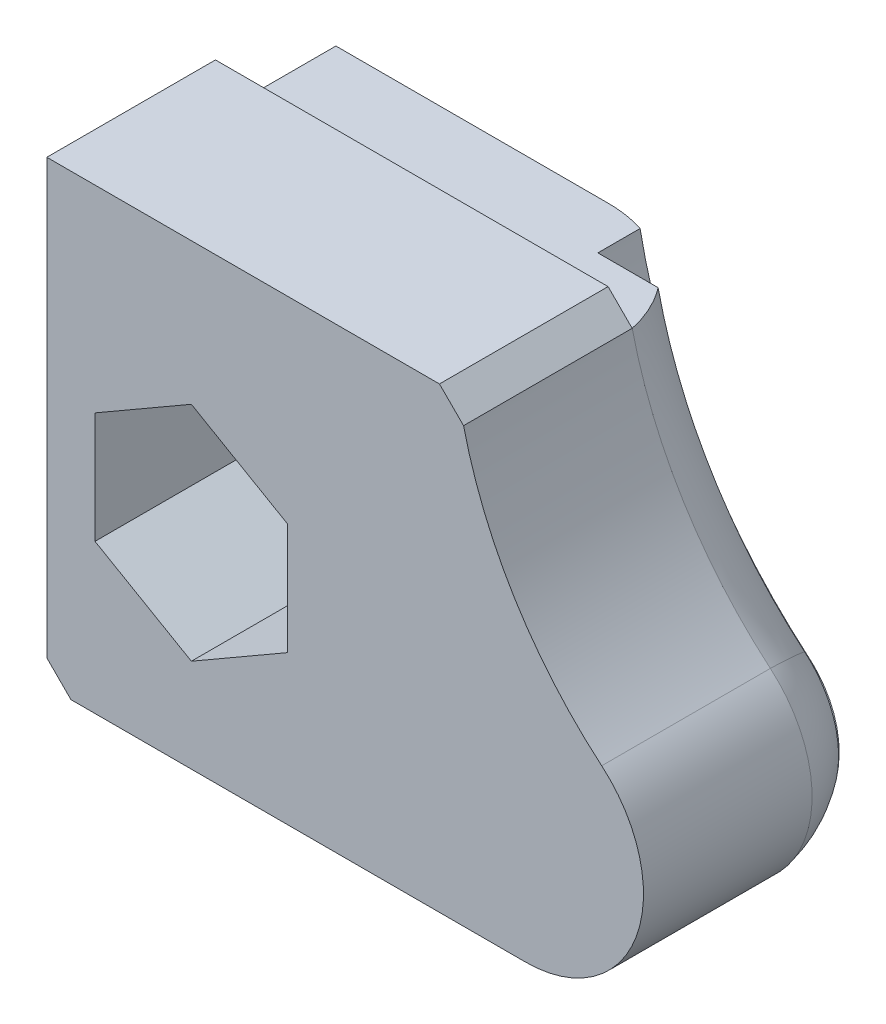
ISO-10303-21;
HEADER;
FILE_DESCRIPTION(('STEP AP214'),'2;1');
FILE_NAME('part.step','',(''),(''),'','','');
FILE_SCHEMA(('AUTOMOTIVE_DESIGN { 1 0 10303 214 1 1 1 1 }'));
ENDSEC;
DATA;
#1=APPLICATION_CONTEXT('core data for automotive mechanical design processes');
#2=APPLICATION_PROTOCOL_DEFINITION('international standard','automotive_design',2000,#1);
#3=PRODUCT_CONTEXT('',#1,'mechanical');
#4=PRODUCT('Part','Part','',(#3));
#5=PRODUCT_RELATED_PRODUCT_CATEGORY('part','',(#4));
#6=PRODUCT_DEFINITION_FORMATION('','',#4);
#7=PRODUCT_DEFINITION_CONTEXT('part definition',#1,'design');
#8=PRODUCT_DEFINITION('design','',#6,#7);
#9=PRODUCT_DEFINITION_SHAPE('','',#8);
#10=(LENGTH_UNIT() NAMED_UNIT(*) SI_UNIT(.MILLI.,.METRE.));
#11=(NAMED_UNIT(*) PLANE_ANGLE_UNIT() SI_UNIT($,.RADIAN.));
#12=(NAMED_UNIT(*) SI_UNIT($,.STERADIAN.) SOLID_ANGLE_UNIT());
#13=UNCERTAINTY_MEASURE_WITH_UNIT(LENGTH_MEASURE(1.E-05),#10,'distance_accuracy_value','');
#14=(GEOMETRIC_REPRESENTATION_CONTEXT(3) GLOBAL_UNCERTAINTY_ASSIGNED_CONTEXT((#13)) GLOBAL_UNIT_ASSIGNED_CONTEXT((#10,
#11,#12)) REPRESENTATION_CONTEXT('',''));
#15=CARTESIAN_POINT('',(0.,0.,0.));
#16=DIRECTION('',(0.,0.,1.));
#17=DIRECTION('',(1.,0.,0.));
#18=AXIS2_PLACEMENT_3D('',#15,#16,#17);
#19=CARTESIAN_POINT('',(0.,0.,5.));
#20=DIRECTION('',(0.,0.,1.));
#21=DIRECTION('',(1.,0.,0.));
#22=AXIS2_PLACEMENT_3D('',#19,#20,#21);
#23=TOROIDAL_SURFACE('',#22,22.3989794855664,5.);
#24=CARTESIAN_POINT('',(-14.4661459746452,-17.1010205144336,5.));
#25=DIRECTION('',(0.763473198654132,-0.645839511749496,0.));
#26=DIRECTION('',(0.645839511749496,0.763473198654133,0.));
#27=AXIS2_PLACEMENT_3D('',#24,#25,#26);
#28=CIRCLE('',#27,5.);
#29=CARTESIAN_POINT('',(-11.8827879276472,-14.0471277198171,2.));
#30=VERTEX_POINT('',#29);
#31=CARTESIAN_POINT('',(-11.3021914556162,-13.3607809764473,4.));
#32=VERTEX_POINT('',#31);
#33=EDGE_CURVE('E202',#30,#32,#28,.T.);
#34=ORIENTED_EDGE('',*,*,#33,.F.);
#35=CARTESIAN_POINT('',(0.,0.,2.));
#36=DIRECTION('',(0.,0.,1.));
#37=DIRECTION('',(1.,0.,0.));
#38=AXIS2_PLACEMENT_3D('',#35,#36,#37);
#39=CIRCLE('',#38,18.3989794855664);
#40=CARTESIAN_POINT('',(-17.9589099365828,-4.,2.));
#41=VERTEX_POINT('',#40);
#42=EDGE_CURVE('E61',#30,#41,#39,.F.);
#43=ORIENTED_EDGE('',*,*,#42,.T.);
#44=CARTESIAN_POINT('',(-17.0367250374008,-4.,4.));
#45=CARTESIAN_POINT('',(-17.0653817765962,-4.,3.86324225807622));
#46=CARTESIAN_POINT('',(-17.0999358907687,-4.,3.72772869698711));
#47=CARTESIAN_POINT('',(-17.1804606447674,-4.,3.46015982354573));
#48=CARTESIAN_POINT('',(-17.2264294320747,-4.,3.32810395387575));
#49=CARTESIAN_POINT('',(-17.3293440827628,-4.,3.06855383654147));
#50=CARTESIAN_POINT('',(-17.3862747744431,-4.,2.94105356960061));
#51=CARTESIAN_POINT('',(-17.5106796250823,-4.,2.69130452779398));
#52=CARTESIAN_POINT('',(-17.5781539589004,-4.,2.56905584006502));
#53=CARTESIAN_POINT('',(-17.7230812278293,-4.,2.33068257351301));
#54=CARTESIAN_POINT('',(-17.8005308056964,-4.,2.2145559527099));
#55=CARTESIAN_POINT('',(-17.9648544264224,-4.,1.98911010794165));
#56=CARTESIAN_POINT('',(-18.0517319760089,-4.,1.87979344089488));
#57=CARTESIAN_POINT('',(-18.2341911969415,-4.,1.66877227064967));
#58=CARTESIAN_POINT('',(-18.3297688994024,-4.,1.56706433465356));
#59=CARTESIAN_POINT('',(-18.5289973167957,-4.,1.37181862571009));
#60=CARTESIAN_POINT('',(-18.6326508881901,-4.,1.27828376865287));
#61=CARTESIAN_POINT('',(-18.8490807894197,-4.,1.0985014561376));
#62=CARTESIAN_POINT('',(-18.9619817957606,-4.,1.01240407017907));
#63=CARTESIAN_POINT('',(-19.1945285125645,-4.,0.849857600666171));
#64=CARTESIAN_POINT('',(-19.3141743564999,-4.,0.773408708141138));
#65=CARTESIAN_POINT('',(-19.5594519302337,-4.,0.630598944815542));
#66=CARTESIAN_POINT('',(-19.6850876893161,-4.,0.564244994085387));
#67=CARTESIAN_POINT('',(-19.9413555281012,-4.,0.442130897146087));
#68=CARTESIAN_POINT('',(-20.0719861118898,-4.,0.386367608505771));
#69=CARTESIAN_POINT('',(-20.350714429283,-4.,0.280718615795549));
#70=CARTESIAN_POINT('',(-20.499249847823,-4.,0.231983641250895));
#71=CARTESIAN_POINT('',(-20.8001281147384,-4.,0.148127527784731));
#72=CARTESIAN_POINT('',(-20.9524713823985,-4.,0.113007895149734));
#73=CARTESIAN_POINT('',(-21.259857759456,-4.,0.0566540717579046));
#74=CARTESIAN_POINT('',(-21.4149033254361,-4.,0.0354332731532387));
#75=CARTESIAN_POINT('',(-21.7262733191489,-4.,0.00709693660430523));
#76=CARTESIAN_POINT('',(-21.8825977138705,-4.,-1.89642914516628E-05));
#77=CARTESIAN_POINT('',(-22.0389265163896,-4.,0.));
#78=B_SPLINE_CURVE_WITH_KNOTS('',3,(#44,#45,#46,#47,#48,#49,#50,#51,#52,#53,#54,#55,#56,#57,#58,
#59,#60,#61,#62,#63,#64,#65,#66,#67,#68,#69,#70,#71,#72,#73,#74,#75,#76,#77),.UNSPECIFIED.,.F.,
.F.,(4,2,2,2,2,2,2,2,2,2,2,2,2,2,2,2,4),(0.,0.419043506548137,0.838019049766633,
1.25641882947906,1.67482554880858,2.09309181638023,2.51151419451018,2.92974664189645,
3.3481276970032,3.77358731554335,4.19905535638494,4.62481375350071,5.05044562274954,
5.51877395788904,5.98715409014758,6.45598486639045,6.92480357838152),.UNSPECIFIED.);
#79=CARTESIAN_POINT('',(-17.0367250374008,-4.,4.));
#80=VERTEX_POINT('',#79);
#81=EDGE_CURVE('E210',#80,#41,#78,.T.);
#82=ORIENTED_EDGE('',*,*,#81,.F.);
#83=CARTESIAN_POINT('',(0.,0.,4.));
#84=DIRECTION('',(0.,0.,-1.));
#85=DIRECTION('',(1.,0.,0.));
#86=AXIS2_PLACEMENT_3D('',#83,#84,#85);
#87=CIRCLE('',#86,17.5);
#88=EDGE_CURVE('E253',#32,#80,#87,.T.);
#89=ORIENTED_EDGE('',*,*,#88,.F.);
#90=EDGE_LOOP('',(#34,#43,#82,#89));
#91=FACE_BOUND('',#90,.T.);
#92=ADVANCED_FACE('F40',(#91),#23,.T.);
#93=CARTESIAN_POINT('',(-33.3367250374008,-4.,4.));
#94=DIRECTION('',(1.,0.,0.));
#95=DIRECTION('',(0.,0.,-1.));
#96=AXIS2_PLACEMENT_3D('',#93,#94,#95);
#97=PLANE('',#96);
#98=DIRECTION('',(0.,-1.,0.));
#99=VECTOR('',#98,1.);
#100=CARTESIAN_POINT('',(-33.3367250374008,-4.,0.));
#101=LINE('',#100,#99);
#102=CARTESIAN_POINT('',(-33.3367250374008,-4.,0.));
#103=VERTEX_POINT('',#102);
#104=CARTESIAN_POINT('',(-33.3367250374008,-17.1010205144336,0.));
#105=VERTEX_POINT('',#104);
#106=EDGE_CURVE('E201',#103,#105,#101,.T.);
#107=ORIENTED_EDGE('',*,*,#106,.T.);
#108=CARTESIAN_POINT('',(-33.3367250374008,-17.1010205144336,5.));
#109=DIRECTION('',(1.,0.,0.));
#110=DIRECTION('',(0.,0.,-1.));
#111=AXIS2_PLACEMENT_3D('',#108,#109,#110);
#112=CIRCLE('',#111,5.);
#113=CARTESIAN_POINT('',(-33.3367250374008,-22.,4.));
#114=VERTEX_POINT('',#113);
#115=EDGE_CURVE('E268',#105,#114,#112,.F.);
#116=ORIENTED_EDGE('',*,*,#115,.T.);
#117=DIRECTION('',(0.,-1.,0.));
#118=VECTOR('',#117,1.);
#119=CARTESIAN_POINT('',(-33.3367250374008,-4.,4.));
#120=LINE('',#119,#118);
#121=CARTESIAN_POINT('',(-33.3367250374008,-4.,4.));
#122=VERTEX_POINT('',#121);
#123=EDGE_CURVE('E280',#122,#114,#120,.T.);
#124=ORIENTED_EDGE('',*,*,#123,.F.);
#125=DIRECTION('',(0.,0.,-1.));
#126=VECTOR('',#125,1.);
#127=CARTESIAN_POINT('',(-33.3367250374008,-4.,4.));
#128=LINE('',#127,#126);
#129=EDGE_CURVE('E287',#122,#103,#128,.T.);
#130=ORIENTED_EDGE('',*,*,#129,.T.);
#131=EDGE_LOOP('',(#107,#116,#124,#130));
#132=FACE_BOUND('',#131,.T.);
#133=ADVANCED_FACE('F227',(#132),#97,.F.);
#134=CARTESIAN_POINT('',(-33.3367250374008,-4.,4.));
#135=DIRECTION('',(0.,-1.,0.));
#136=DIRECTION('',(0.,0.,-1.));
#137=AXIS2_PLACEMENT_3D('',#134,#135,#136);
#138=PLANE('',#137);
#139=DIRECTION('',(1.,0.,0.));
#140=VECTOR('',#139,1.);
#141=CARTESIAN_POINT('',(-33.3367250374008,-4.,2.));
#142=LINE('',#141,#140);
#143=CARTESIAN_POINT('',(-20.4616824235623,-4.,2.));
#144=VERTEX_POINT('',#143);
#145=EDGE_CURVE('E365',#144,#41,#142,.T.);
#146=ORIENTED_EDGE('',*,*,#145,.F.);
#147=DIRECTION('',(0.,0.,-1.));
#148=VECTOR('',#147,1.);
#149=CARTESIAN_POINT('',(-20.4616824235623,-4.,2.));
#150=LINE('',#149,#148);
#151=CARTESIAN_POINT('',(-20.4616824235623,-4.,0.246313291602664));
#152=VERTEX_POINT('',#151);
#153=EDGE_CURVE('E190',#144,#152,#150,.T.);
#154=ORIENTED_EDGE('',*,*,#153,.T.);
#155=CARTESIAN_POINT('',(-22.0389265163896,-4.,0.));
#156=VERTEX_POINT('',#155);
#157=EDGE_CURVE('E218',#152,#156,#78,.T.);
#158=ORIENTED_EDGE('',*,*,#157,.T.);
#159=DIRECTION('',(-1.,0.,0.));
#160=VECTOR('',#159,1.);
#161=CARTESIAN_POINT('',(-33.3367250374008,-4.,0.));
#162=LINE('',#161,#160);
#163=EDGE_CURVE('E205',#156,#103,#162,.T.);
#164=ORIENTED_EDGE('',*,*,#163,.T.);
#165=ORIENTED_EDGE('',*,*,#129,.F.);
#166=DIRECTION('',(-1.,0.,0.));
#167=VECTOR('',#166,1.);
#168=CARTESIAN_POINT('',(-33.3367250374008,-4.,4.));
#169=LINE('',#168,#167);
#170=EDGE_CURVE('E282',#80,#122,#169,.T.);
#171=ORIENTED_EDGE('',*,*,#170,.F.);
#172=ORIENTED_EDGE('',*,*,#81,.T.);
#173=EDGE_LOOP('',(#146,#154,#158,#164,#165,#171,#172));
#174=FACE_BOUND('',#173,.T.);
#175=ADVANCED_FACE('F221',(#174),#138,.F.);
#176=CARTESIAN_POINT('',(0.,0.,0.));
#177=DIRECTION('',(0.,0.,1.));
#178=DIRECTION('',(1.,0.,0.));
#179=AXIS2_PLACEMENT_3D('',#176,#177,#178);
#180=PLANE('',#179);
#181=DIRECTION('',(0.,-1.,0.));
#182=VECTOR('',#181,1.);
#183=CARTESIAN_POINT('',(-32.3367250374008,0.,0.));
#184=LINE('',#183,#182);
#185=CARTESIAN_POINT('',(-32.3367250374008,-11.1905989232415,0.));
#186=VERTEX_POINT('',#185);
#187=CARTESIAN_POINT('',(-32.3367250374008,-15.8094010767585,0.));
#188=VERTEX_POINT('',#187);
#189=EDGE_CURVE('E304',#186,#188,#184,.T.);
#190=ORIENTED_EDGE('',*,*,#189,.T.);
#191=DIRECTION('',(0.866025403784439,-0.5,0.));
#192=VECTOR('',#191,1.);
#193=CARTESIAN_POINT('',(-14.9298527348952,-25.8592634863596,0.));
#194=LINE('',#193,#192);
#195=CARTESIAN_POINT('',(-30.0995745473039,-17.1010205144336,0.));
#196=VERTEX_POINT('',#195);
#197=EDGE_CURVE('E302',#188,#196,#194,.T.);
#198=ORIENTED_EDGE('',*,*,#197,.T.);
#199=DIRECTION('',(1.,0.,0.));
#200=VECTOR('',#199,1.);
#201=CARTESIAN_POINT('',(0.,-17.1010205144336,0.));
#202=LINE('',#201,#200);
#203=EDGE_CURVE('E292',#196,#105,#202,.F.);
#204=ORIENTED_EDGE('',*,*,#203,.T.);
#205=ORIENTED_EDGE('',*,*,#106,.F.);
#206=ORIENTED_EDGE('',*,*,#163,.F.);
#207=CARTESIAN_POINT('',(0.,0.,0.));
#208=DIRECTION('',(0.,0.,1.));
#209=DIRECTION('',(1.,0.,0.));
#210=AXIS2_PLACEMENT_3D('',#207,#208,#209);
#211=CIRCLE('',#210,22.3989794855664);
#212=CARTESIAN_POINT('',(-14.4661459746452,-17.1010205144336,0.));
#213=VERTEX_POINT('',#212);
#214=EDGE_CURVE('E185',#156,#213,#211,.T.);
#215=ORIENTED_EDGE('',*,*,#214,.T.);
#216=CARTESIAN_POINT('',(-26.5738755274977,-17.1010205144336,0.));
#217=VERTEX_POINT('',#216);
#218=EDGE_CURVE('E267',#213,#217,#202,.F.);
#219=ORIENTED_EDGE('',*,*,#218,.T.);
#220=DIRECTION('',(0.866025403784439,0.5,0.));
#221=VECTOR('',#220,1.);
#222=CARTESIAN_POINT('',(0.761490216194761,-1.31893974391593,0.));
#223=LINE('',#222,#221);
#224=CARTESIAN_POINT('',(-24.3367250374008,-15.8094010767585,0.));
#225=VERTEX_POINT('',#224);
#226=EDGE_CURVE('E69',#217,#225,#223,.T.);
#227=ORIENTED_EDGE('',*,*,#226,.T.);
#228=DIRECTION('',(0.,1.,0.));
#229=VECTOR('',#228,1.);
#230=CARTESIAN_POINT('',(-24.3367250374008,0.,0.));
#231=LINE('',#230,#229);
#232=CARTESIAN_POINT('',(-24.3367250374008,-11.1905989232415,0.));
#233=VERTEX_POINT('',#232);
#234=EDGE_CURVE('E404',#225,#233,#231,.T.);
#235=ORIENTED_EDGE('',*,*,#234,.T.);
#236=DIRECTION('',(-0.866025403784439,0.5,0.));
#237=VECTOR('',#236,1.);
#238=CARTESIAN_POINT('',(-10.9298527348952,-18.9310602560841,0.));
#239=LINE('',#238,#237);
#240=CARTESIAN_POINT('',(-28.3367250374008,-8.88119784648299,0.));
#241=VERTEX_POINT('',#240);
#242=EDGE_CURVE('E407',#233,#241,#239,.T.);
#243=ORIENTED_EDGE('',*,*,#242,.T.);
#244=DIRECTION('',(-0.866025403784439,-0.5,0.));
#245=VECTOR('',#244,1.);
#246=CARTESIAN_POINT('',(-3.23850978380524,5.60926348635958,0.));
#247=LINE('',#246,#245);
#248=EDGE_CURVE('E410',#241,#186,#247,.T.);
#249=ORIENTED_EDGE('',*,*,#248,.T.);
#250=EDGE_LOOP('',(#190,#198,#204,#205,#206,#215,#219,#227,#235,#243,#249));
#251=FACE_BOUND('',#250,.T.);
#252=ADVANCED_FACE('F226',(#251),#180,.F.);
#253=CARTESIAN_POINT('',(-33.3367250374008,-17.1010205144336,5.));
#254=DIRECTION('',(1.,0.,0.));
#255=DIRECTION('',(0.,0.,-1.));
#256=AXIS2_PLACEMENT_3D('',#253,#254,#255);
#257=CYLINDRICAL_SURFACE('',#256,5.);
#258=CARTESIAN_POINT('',(-30.0995745473039,-17.1010205144336,5.));
#259=DIRECTION('',(-0.5,-0.866025403784439,0.));
#260=DIRECTION('',(0.866025403784439,-0.5,0.));
#261=AXIS2_PLACEMENT_3D('',#258,#259,#260);
#262=ELLIPSE('',#261,10.,5.);
#263=CARTESIAN_POINT('',(-28.3367250374008,-18.118802153517,0.104683816631986));
#264=VERTEX_POINT('',#263);
#265=EDGE_CURVE('E297',#264,#196,#262,.F.);
#266=ORIENTED_EDGE('',*,*,#265,.F.);
#267=CARTESIAN_POINT('',(-26.5738755274977,-17.1010205144336,5.));
#268=DIRECTION('',(0.5,-0.866025403784439,0.));
#269=DIRECTION('',(0.866025403784439,0.5,0.));
#270=AXIS2_PLACEMENT_3D('',#267,#268,#269);
#271=ELLIPSE('',#270,10.,5.);
#272=EDGE_CURVE('E391',#217,#264,#271,.F.);
#273=ORIENTED_EDGE('',*,*,#272,.F.);
#274=ORIENTED_EDGE('',*,*,#218,.F.);
#275=CARTESIAN_POINT('',(-14.4661459746452,-17.1010205144336,5.));
#276=DIRECTION('',(1.,0.,0.));
#277=DIRECTION('',(0.,0.,-1.));
#278=AXIS2_PLACEMENT_3D('',#275,#276,#277);
#279=CIRCLE('',#278,5.);
#280=CARTESIAN_POINT('',(-14.4661459746452,-22.,4.));
#281=VERTEX_POINT('',#280);
#282=EDGE_CURVE('E198',#213,#281,#279,.F.);
#283=ORIENTED_EDGE('',*,*,#282,.T.);
#284=DIRECTION('',(1.,0.,0.));
#285=VECTOR('',#284,1.);
#286=CARTESIAN_POINT('',(-33.3367250374008,-22.,4.));
#287=LINE('',#286,#285);
#288=EDGE_CURVE('E264',#114,#281,#287,.T.);
#289=ORIENTED_EDGE('',*,*,#288,.F.);
#290=ORIENTED_EDGE('',*,*,#115,.F.);
#291=ORIENTED_EDGE('',*,*,#203,.F.);
#292=EDGE_LOOP('',(#266,#273,#274,#283,#289,#290,#291));
#293=FACE_BOUND('',#292,.T.);
#294=ADVANCED_FACE('F233',(#293),#257,.T.);
#295=CARTESIAN_POINT('',(0.,0.,0.246313291602664));
#296=DIRECTION('',(0.,0.,1.));
#297=DIRECTION('',(1.,0.,0.));
#298=AXIS2_PLACEMENT_3D('',#295,#296,#297);
#299=CIRCLE('',#298,20.8489915248368);
#300=CARTESIAN_POINT('',(-13.46510250687,-15.9176462481801,0.246313291602662));
#301=VERTEX_POINT('',#300);
#302=EDGE_CURVE('E364',#301,#152,#299,.F.);
#303=ORIENTED_EDGE('',*,*,#302,.F.);
#304=EDGE_CURVE('E196',#213,#301,#28,.T.);
#305=ORIENTED_EDGE('',*,*,#304,.F.);
#306=ORIENTED_EDGE('',*,*,#214,.F.);
#307=ORIENTED_EDGE('',*,*,#157,.F.);
#308=EDGE_LOOP('',(#303,#305,#306,#307));
#309=FACE_BOUND('',#308,.T.);
#310=ADVANCED_FACE('F42',(#309),#23,.T.);
#311=CARTESIAN_POINT('',(-14.4661459746452,-17.1010205144336,5.));
#312=DIRECTION('',(-0.632790903805795,-0.748047907597264,0.2));
#313=DIRECTION('',(0.763473198654132,-0.645839511749496,0.));
#314=AXIS2_PLACEMENT_3D('',#311,#312,#313);
#315=SPHERICAL_SURFACE('',#314,5.);
#316=CARTESIAN_POINT('',(-10.5626974666883,-17.9752571561559,2.0002));
#317=CARTESIAN_POINT('',(-10.6310690017644,-17.9350806679381,1.89950336424527));
#318=CARTESIAN_POINT('',(-10.7027523055726,-17.8924329314273,1.80203240841822));
#319=CARTESIAN_POINT('',(-10.8521318042913,-17.8022271935745,1.6142040933521));
#320=CARTESIAN_POINT('',(-10.9298289667784,-17.7546684016741,1.52384788355007));
#321=CARTESIAN_POINT('',(-11.0906917465531,-17.6546306302191,1.35084885738359));
#322=CARTESIAN_POINT('',(-11.1738633004437,-17.6021462820811,1.26821465796061));
#323=CARTESIAN_POINT('',(-11.3448966521043,-17.4924008814415,1.11141526390583));
#324=CARTESIAN_POINT('',(-11.4327581279176,-17.4351401566802,1.03724948902277));
#325=CARTESIAN_POINT('',(-11.6125578065063,-17.3159059269642,0.897881827525671));
#326=CARTESIAN_POINT('',(-11.7045013752349,-17.2539261374015,0.832692231039008));
#327=CARTESIAN_POINT('',(-11.8916013780367,-17.1255113982568,0.711918047230162));
#328=CARTESIAN_POINT('',(-11.9867589970769,-17.0590747964205,0.656337049681473));
#329=CARTESIAN_POINT('',(-12.1793191068657,-16.9221326498876,0.5553503630312));
#330=CARTESIAN_POINT('',(-12.2767188317057,-16.851631972458,0.509932807671089));
#331=CARTESIAN_POINT('',(-12.4730638926568,-16.7068251659132,0.429580651177477));
#332=CARTESIAN_POINT('',(-12.5720097437214,-16.6325177493033,0.394649624509826));
#333=CARTESIAN_POINT('',(-12.7678844455617,-16.4826081635787,0.336407295940639));
#334=CARTESIAN_POINT('',(-12.8647957954896,-16.407094848735,0.31280822943143));
#335=CARTESIAN_POINT('',(-13.05846444162,-16.2533761994617,0.276065899944095));
#336=CARTESIAN_POINT('',(-13.1552217409946,-16.1751709212326,0.262922418821331));
#337=CARTESIAN_POINT('',(-13.3478082558102,-16.0166167178819,0.247211002747977));
#338=CARTESIAN_POINT('',(-13.4436376304158,-15.9362681695972,0.244641220870305));
#339=CARTESIAN_POINT('',(-13.6336301393224,-15.7740355269512,0.250090221175941));
#340=CARTESIAN_POINT('',(-13.727793706307,-15.6921518430614,0.258106211596722));
#341=CARTESIAN_POINT('',(-13.9325388540946,-15.5108670934743,0.287338834043145));
#342=CARTESIAN_POINT('',(-14.0426097150937,-15.4112578434375,0.310887933334233));
#343=CARTESIAN_POINT('',(-14.2581380238677,-15.2120905506025,0.37277637554794));
#344=CARTESIAN_POINT('',(-14.3636041857801,-15.1125327978349,0.411086301912296));
#345=CARTESIAN_POINT('',(-14.4663459746452,-15.0135033135037,0.456623293648055));
#346=B_SPLINE_CURVE_WITH_KNOTS('',3,(#316,#317,#318,#319,#320,#321,#322,#323,#324,#325,#326,
#327,#328,#329,#330,#331,#332,#333,#334,#335,#336,#337,#338,#339,#340,#341,#342,#343,#344,#345),
.UNSPECIFIED.,.F.,.F.,(4,2,2,2,2,2,2,2,2,2,2,2,2,2,4),(0.,0.384427352845929,0.768916685735513,
1.15383006858699,1.5387170615623,1.92412590769741,2.30967843289443,2.69477843256656,
3.08000954978593,3.45485934051473,3.82970131019732,4.20447780277805,4.57915547611183,
5.02925574965723,5.47846362849167),.UNSPECIFIED.);
#347=CARTESIAN_POINT('',(-10.5628332983739,-17.9751773374696,2.));
#348=VERTEX_POINT('',#347);
#349=EDGE_CURVE('E11',#348,#301,#346,.T.);
#350=ORIENTED_EDGE('',*,*,#349,.F.);
#351=CARTESIAN_POINT('',(-14.4661459746452,-17.1010205144336,2.));
#352=DIRECTION('',(0.,0.,-1.));
#353=DIRECTION('',(-1.,0.,0.));
#354=AXIS2_PLACEMENT_3D('',#351,#352,#353);
#355=CIRCLE('',#354,4.);
#356=EDGE_CURVE('E54',#348,#30,#355,.F.);
#357=ORIENTED_EDGE('',*,*,#356,.T.);
#358=ORIENTED_EDGE('',*,*,#33,.T.);
#359=CARTESIAN_POINT('',(-14.4661459746452,-17.1010205144336,4.));
#360=DIRECTION('',(0.,0.,1.));
#361=DIRECTION('',(1.,0.,0.));
#362=AXIS2_PLACEMENT_3D('',#359,#360,#361);
#363=CIRCLE('',#362,4.89897948556636);
#364=EDGE_CURVE('E219',#281,#32,#363,.T.);
#365=ORIENTED_EDGE('',*,*,#364,.F.);
#366=ORIENTED_EDGE('',*,*,#282,.F.);
#367=ORIENTED_EDGE('',*,*,#304,.T.);
#368=EDGE_LOOP('',(#350,#357,#358,#365,#366,#367));
#369=FACE_BOUND('',#368,.T.);
#370=ADVANCED_FACE('F193',(#369),#315,.T.);
#371=CARTESIAN_POINT('',(-14.4661459746452,-17.1010205144336,4.));
#372=DIRECTION('',(0.,0.,1.));
#373=DIRECTION('',(1.,0.,0.));
#374=AXIS2_PLACEMENT_3D('',#371,#372,#373);
#375=PLANE('',#374);
#376=ORIENTED_EDGE('',*,*,#170,.T.);
#377=ORIENTED_EDGE('',*,*,#123,.T.);
#378=DIRECTION('',(0.707106781186547,-0.707106781186547,0.));
#379=VECTOR('',#378,1.);
#380=CARTESIAN_POINT('',(-33.3367250374008,-22.,4.));
#381=LINE('',#380,#379);
#382=CARTESIAN_POINT('',(-34.3367250374008,-21.,4.));
#383=VERTEX_POINT('',#382);
#384=EDGE_CURVE('E316',#383,#114,#381,.T.);
#385=ORIENTED_EDGE('',*,*,#384,.F.);
#386=DIRECTION('',(0.,-1.,0.));
#387=VECTOR('',#386,1.);
#388=CARTESIAN_POINT('',(-34.3367250374008,-21.,4.));
#389=LINE('',#388,#387);
#390=CARTESIAN_POINT('',(-34.3367250374008,-3.,4.));
#391=VERTEX_POINT('',#390);
#392=EDGE_CURVE('E329',#391,#383,#389,.T.);
#393=ORIENTED_EDGE('',*,*,#392,.F.);
#394=DIRECTION('',(-1.,0.,0.));
#395=VECTOR('',#394,1.);
#396=CARTESIAN_POINT('',(-34.3367250374008,-3.,4.));
#397=LINE('',#396,#395);
#398=CARTESIAN_POINT('',(-18.0367250374008,-3.,4.));
#399=VERTEX_POINT('',#398);
#400=EDGE_CURVE('E309',#399,#391,#397,.T.);
#401=ORIENTED_EDGE('',*,*,#400,.F.);
#402=DIRECTION('',(-0.707106781186549,0.707106781186546,0.));
#403=VECTOR('',#402,1.);
#404=CARTESIAN_POINT('',(-18.0367250374008,-3.,4.));
#405=LINE('',#404,#403);
#406=EDGE_CURVE('E307',#80,#399,#405,.T.);
#407=ORIENTED_EDGE('',*,*,#406,.F.);
#408=EDGE_LOOP('',(#376,#377,#385,#393,#401,#407));
#409=FACE_BOUND('',#408,.T.);
#410=ADVANCED_FACE('F238',(#409),#375,.F.);
#411=CARTESIAN_POINT('',(-33.3367250374008,-22.,11.));
#412=DIRECTION('',(0.,1.,0.));
#413=DIRECTION('',(0.,0.,1.));
#414=AXIS2_PLACEMENT_3D('',#411,#412,#413);
#415=PLANE('',#414);
#416=ORIENTED_EDGE('',*,*,#288,.T.);
#417=DIRECTION('',(0.,0.,-1.));
#418=VECTOR('',#417,1.);
#419=CARTESIAN_POINT('',(-14.4661459746452,-22.,11.));
#420=LINE('',#419,#418);
#421=CARTESIAN_POINT('',(-14.4661459746452,-22.,11.));
#422=VERTEX_POINT('',#421);
#423=EDGE_CURVE('E207',#422,#281,#420,.T.);
#424=ORIENTED_EDGE('',*,*,#423,.F.);
#425=DIRECTION('',(1.,0.,0.));
#426=VECTOR('',#425,1.);
#427=CARTESIAN_POINT('',(-33.3367250374008,-22.,11.));
#428=LINE('',#427,#426);
#429=CARTESIAN_POINT('',(-33.3367250374008,-22.,11.));
#430=VERTEX_POINT('',#429);
#431=EDGE_CURVE('E314',#430,#422,#428,.T.);
#432=ORIENTED_EDGE('',*,*,#431,.F.);
#433=DIRECTION('',(0.,0.,-1.));
#434=VECTOR('',#433,1.);
#435=CARTESIAN_POINT('',(-33.3367250374008,-22.,11.));
#436=LINE('',#435,#434);
#437=EDGE_CURVE('E279',#430,#114,#436,.T.);
#438=ORIENTED_EDGE('',*,*,#437,.T.);
#439=EDGE_LOOP('',(#416,#424,#432,#438));
#440=FACE_BOUND('',#439,.T.);
#441=ADVANCED_FACE('F243',(#440),#415,.F.);
#442=CARTESIAN_POINT('',(-14.4661459746452,-17.1010205144336,11.));
#443=DIRECTION('',(0.,0.,-1.));
#444=DIRECTION('',(-1.,0.,0.));
#445=AXIS2_PLACEMENT_3D('',#442,#443,#444);
#446=CYLINDRICAL_SURFACE('',#445,4.89897948556635);
#447=ORIENTED_EDGE('',*,*,#364,.T.);
#448=DIRECTION('',(0.,0.,-1.));
#449=VECTOR('',#448,1.);
#450=CARTESIAN_POINT('',(-11.3021914556162,-13.3607809764473,11.));
#451=LINE('',#450,#449);
#452=CARTESIAN_POINT('',(-11.3021914556162,-13.3607809764473,11.));
#453=VERTEX_POINT('',#452);
#454=EDGE_CURVE('E275',#453,#32,#451,.T.);
#455=ORIENTED_EDGE('',*,*,#454,.F.);
#456=CARTESIAN_POINT('',(-14.4661459746452,-17.1010205144336,11.));
#457=DIRECTION('',(0.,0.,1.));
#458=DIRECTION('',(1.,0.,0.));
#459=AXIS2_PLACEMENT_3D('',#456,#457,#458);
#460=CIRCLE('',#459,4.89897948556635);
#461=EDGE_CURVE('E271',#422,#453,#460,.T.);
#462=ORIENTED_EDGE('',*,*,#461,.F.);
#463=ORIENTED_EDGE('',*,*,#423,.T.);
#464=EDGE_LOOP('',(#447,#455,#462,#463));
#465=FACE_BOUND('',#464,.T.);
#466=ADVANCED_FACE('F270',(#465),#446,.T.);
#467=CARTESIAN_POINT('',(0.,0.,11.));
#468=DIRECTION('',(0.,0.,-1.));
#469=DIRECTION('',(-1.,0.,0.));
#470=AXIS2_PLACEMENT_3D('',#467,#468,#469);
#471=CYLINDRICAL_SURFACE('',#470,17.5);
#472=ORIENTED_EDGE('',*,*,#88,.T.);
#473=DIRECTION('',(0.,0.,-1.));
#474=VECTOR('',#473,1.);
#475=CARTESIAN_POINT('',(-17.0367250374008,-4.,11.));
#476=LINE('',#475,#474);
#477=CARTESIAN_POINT('',(-17.0367250374008,-4.,11.));
#478=VERTEX_POINT('',#477);
#479=EDGE_CURVE('E343',#478,#80,#476,.T.);
#480=ORIENTED_EDGE('',*,*,#479,.F.);
#481=CARTESIAN_POINT('',(0.,0.,11.));
#482=DIRECTION('',(0.,0.,-1.));
#483=DIRECTION('',(1.,0.,0.));
#484=AXIS2_PLACEMENT_3D('',#481,#482,#483);
#485=CIRCLE('',#484,17.5);
#486=EDGE_CURVE('E318',#453,#478,#485,.T.);
#487=ORIENTED_EDGE('',*,*,#486,.F.);
#488=ORIENTED_EDGE('',*,*,#454,.T.);
#489=EDGE_LOOP('',(#472,#480,#487,#488));
#490=FACE_BOUND('',#489,.T.);
#491=ADVANCED_FACE('F348',(#490),#471,.F.);
#492=CARTESIAN_POINT('',(-18.0367250374008,-3.,11.));
#493=DIRECTION('',(-0.707106781186546,-0.707106781186549,0.));
#494=DIRECTION('',(0.707106781186549,-0.707106781186546,0.));
#495=AXIS2_PLACEMENT_3D('',#492,#493,#494);
#496=PLANE('',#495);
#497=ORIENTED_EDGE('',*,*,#406,.T.);
#498=DIRECTION('',(0.,0.,-1.));
#499=VECTOR('',#498,1.);
#500=CARTESIAN_POINT('',(-18.0367250374008,-3.,11.));
#501=LINE('',#500,#499);
#502=CARTESIAN_POINT('',(-18.0367250374008,-3.,11.));
#503=VERTEX_POINT('',#502);
#504=EDGE_CURVE('E340',#503,#399,#501,.T.);
#505=ORIENTED_EDGE('',*,*,#504,.F.);
#506=DIRECTION('',(-0.707106781186549,0.707106781186546,0.));
#507=VECTOR('',#506,1.);
#508=CARTESIAN_POINT('',(-18.0367250374008,-3.,11.));
#509=LINE('',#508,#507);
#510=EDGE_CURVE('E320',#478,#503,#509,.T.);
#511=ORIENTED_EDGE('',*,*,#510,.F.);
#512=ORIENTED_EDGE('',*,*,#479,.T.);
#513=EDGE_LOOP('',(#497,#505,#511,#512));
#514=FACE_BOUND('',#513,.T.);
#515=ADVANCED_FACE('F455',(#514),#496,.F.);
#516=CARTESIAN_POINT('',(-34.3367250374008,-3.,11.));
#517=DIRECTION('',(0.,-1.,0.));
#518=DIRECTION('',(0.,0.,-1.));
#519=AXIS2_PLACEMENT_3D('',#516,#517,#518);
#520=PLANE('',#519);
#521=ORIENTED_EDGE('',*,*,#400,.T.);
#522=DIRECTION('',(0.,0.,-1.));
#523=VECTOR('',#522,1.);
#524=CARTESIAN_POINT('',(-34.3367250374008,-3.,11.));
#525=LINE('',#524,#523);
#526=CARTESIAN_POINT('',(-34.3367250374008,-3.,11.));
#527=VERTEX_POINT('',#526);
#528=EDGE_CURVE('E337',#527,#391,#525,.T.);
#529=ORIENTED_EDGE('',*,*,#528,.F.);
#530=DIRECTION('',(-1.,0.,0.));
#531=VECTOR('',#530,1.);
#532=CARTESIAN_POINT('',(-34.3367250374008,-3.,11.));
#533=LINE('',#532,#531);
#534=EDGE_CURVE('E322',#503,#527,#533,.T.);
#535=ORIENTED_EDGE('',*,*,#534,.F.);
#536=ORIENTED_EDGE('',*,*,#504,.T.);
#537=EDGE_LOOP('',(#521,#529,#535,#536));
#538=FACE_BOUND('',#537,.T.);
#539=ADVANCED_FACE('F451',(#538),#520,.F.);
#540=CARTESIAN_POINT('',(-34.3367250374008,-21.,11.));
#541=DIRECTION('',(1.,0.,0.));
#542=DIRECTION('',(0.,0.,-1.));
#543=AXIS2_PLACEMENT_3D('',#540,#541,#542);
#544=PLANE('',#543);
#545=ORIENTED_EDGE('',*,*,#392,.T.);
#546=DIRECTION('',(0.,0.,-1.));
#547=VECTOR('',#546,1.);
#548=CARTESIAN_POINT('',(-34.3367250374008,-21.,11.));
#549=LINE('',#548,#547);
#550=CARTESIAN_POINT('',(-34.3367250374008,-21.,11.));
#551=VERTEX_POINT('',#550);
#552=EDGE_CURVE('E334',#551,#383,#549,.T.);
#553=ORIENTED_EDGE('',*,*,#552,.F.);
#554=DIRECTION('',(0.,-1.,0.));
#555=VECTOR('',#554,1.);
#556=CARTESIAN_POINT('',(-34.3367250374008,-21.,11.));
#557=LINE('',#556,#555);
#558=EDGE_CURVE('E324',#527,#551,#557,.T.);
#559=ORIENTED_EDGE('',*,*,#558,.F.);
#560=ORIENTED_EDGE('',*,*,#528,.T.);
#561=EDGE_LOOP('',(#545,#553,#559,#560));
#562=FACE_BOUND('',#561,.T.);
#563=ADVANCED_FACE('F448',(#562),#544,.F.);
#564=CARTESIAN_POINT('',(-33.3367250374008,-22.,11.));
#565=DIRECTION('',(0.707106781186548,0.707106781186548,0.));
#566=DIRECTION('',(-0.707106781186548,0.707106781186548,0.));
#567=AXIS2_PLACEMENT_3D('',#564,#565,#566);
#568=PLANE('',#567);
#569=ORIENTED_EDGE('',*,*,#384,.T.);
#570=ORIENTED_EDGE('',*,*,#437,.F.);
#571=DIRECTION('',(0.707106781186547,-0.707106781186547,0.));
#572=VECTOR('',#571,1.);
#573=CARTESIAN_POINT('',(-33.3367250374008,-22.,11.));
#574=LINE('',#573,#572);
#575=EDGE_CURVE('E326',#551,#430,#574,.T.);
#576=ORIENTED_EDGE('',*,*,#575,.F.);
#577=ORIENTED_EDGE('',*,*,#552,.T.);
#578=EDGE_LOOP('',(#569,#570,#576,#577));
#579=FACE_BOUND('',#578,.T.);
#580=ADVANCED_FACE('F358',(#579),#568,.F.);
#581=CARTESIAN_POINT('',(-14.4661459746452,-17.1010205144336,11.));
#582=DIRECTION('',(0.,0.,1.));
#583=DIRECTION('',(1.,0.,0.));
#584=AXIS2_PLACEMENT_3D('',#581,#582,#583);
#585=PLANE('',#584);
#586=DIRECTION('',(0.866025403784439,-0.5,0.));
#587=VECTOR('',#586,1.);
#588=CARTESIAN_POINT('',(-32.3367250374008,-15.8094010767585,11.));
#589=LINE('',#588,#587);
#590=CARTESIAN_POINT('',(-32.3367250374008,-15.8094010767585,11.));
#591=VERTEX_POINT('',#590);
#592=CARTESIAN_POINT('',(-28.3367250374008,-18.118802153517,11.));
#593=VERTEX_POINT('',#592);
#594=EDGE_CURVE('E367',#591,#593,#589,.T.);
#595=ORIENTED_EDGE('',*,*,#594,.F.);
#596=DIRECTION('',(0.,-1.,0.));
#597=VECTOR('',#596,1.);
#598=CARTESIAN_POINT('',(-32.3367250374008,-11.1905989232415,11.));
#599=LINE('',#598,#597);
#600=CARTESIAN_POINT('',(-32.3367250374008,-11.1905989232415,11.));
#601=VERTEX_POINT('',#600);
#602=EDGE_CURVE('E385',#601,#591,#599,.T.);
#603=ORIENTED_EDGE('',*,*,#602,.F.);
#604=DIRECTION('',(-0.866025403784439,-0.5,0.));
#605=VECTOR('',#604,1.);
#606=CARTESIAN_POINT('',(-28.3367250374008,-8.88119784648299,11.));
#607=LINE('',#606,#605);
#608=CARTESIAN_POINT('',(-28.3367250374008,-8.88119784648299,11.));
#609=VERTEX_POINT('',#608);
#610=EDGE_CURVE('E382',#609,#601,#607,.T.);
#611=ORIENTED_EDGE('',*,*,#610,.F.);
#612=DIRECTION('',(-0.866025403784439,0.5,0.));
#613=VECTOR('',#612,1.);
#614=CARTESIAN_POINT('',(-24.3367250374008,-11.1905989232415,11.));
#615=LINE('',#614,#613);
#616=CARTESIAN_POINT('',(-24.3367250374008,-11.1905989232415,11.));
#617=VERTEX_POINT('',#616);
#618=EDGE_CURVE('E379',#617,#609,#615,.T.);
#619=ORIENTED_EDGE('',*,*,#618,.F.);
#620=DIRECTION('',(0.,1.,0.));
#621=VECTOR('',#620,1.);
#622=CARTESIAN_POINT('',(-24.3367250374008,-15.8094010767585,11.));
#623=LINE('',#622,#621);
#624=CARTESIAN_POINT('',(-24.3367250374008,-15.8094010767585,11.));
#625=VERTEX_POINT('',#624);
#626=EDGE_CURVE('E376',#625,#617,#623,.T.);
#627=ORIENTED_EDGE('',*,*,#626,.F.);
#628=DIRECTION('',(0.866025403784439,0.5,0.));
#629=VECTOR('',#628,1.);
#630=CARTESIAN_POINT('',(-28.3367250374008,-18.118802153517,11.));
#631=LINE('',#630,#629);
#632=EDGE_CURVE('E373',#593,#625,#631,.T.);
#633=ORIENTED_EDGE('',*,*,#632,.F.);
#634=EDGE_LOOP('',(#595,#603,#611,#619,#627,#633));
#635=FACE_BOUND('',#634,.T.);
#636=ORIENTED_EDGE('',*,*,#431,.T.);
#637=ORIENTED_EDGE('',*,*,#461,.T.);
#638=ORIENTED_EDGE('',*,*,#486,.T.);
#639=ORIENTED_EDGE('',*,*,#510,.T.);
#640=ORIENTED_EDGE('',*,*,#534,.T.);
#641=ORIENTED_EDGE('',*,*,#558,.T.);
#642=ORIENTED_EDGE('',*,*,#575,.T.);
#643=EDGE_LOOP('',(#636,#637,#638,#639,#640,#641,#642));
#644=FACE_BOUND('',#643,.T.);
#645=ADVANCED_FACE('F352',(#635,#644),#585,.T.);
#646=CARTESIAN_POINT('',(-32.3367250374008,-15.8094010767585,-1.));
#647=DIRECTION('',(-0.5,-0.866025403784439,0.));
#648=DIRECTION('',(0.866025403784439,-0.5,0.));
#649=AXIS2_PLACEMENT_3D('',#646,#647,#648);
#650=PLANE('',#649);
#651=DIRECTION('',(0.,0.,1.));
#652=VECTOR('',#651,1.);
#653=CARTESIAN_POINT('',(-32.3367250374008,-15.8094010767585,-1.));
#654=LINE('',#653,#652);
#655=EDGE_CURVE('E389',#188,#591,#654,.T.);
#656=ORIENTED_EDGE('',*,*,#655,.T.);
#657=ORIENTED_EDGE('',*,*,#594,.T.);
#658=DIRECTION('',(0.,0.,1.));
#659=VECTOR('',#658,1.);
#660=CARTESIAN_POINT('',(-28.3367250374008,-18.118802153517,-1.));
#661=LINE('',#660,#659);
#662=EDGE_CURVE('E388',#264,#593,#661,.T.);
#663=ORIENTED_EDGE('',*,*,#662,.F.);
#664=ORIENTED_EDGE('',*,*,#265,.T.);
#665=ORIENTED_EDGE('',*,*,#197,.F.);
#666=EDGE_LOOP('',(#656,#657,#663,#664,#665));
#667=FACE_BOUND('',#666,.T.);
#668=ADVANCED_FACE('F427',(#667),#650,.F.);
#669=CARTESIAN_POINT('',(-32.3367250374008,-11.1905989232415,-1.));
#670=DIRECTION('',(-1.,0.,0.));
#671=DIRECTION('',(0.,0.,1.));
#672=AXIS2_PLACEMENT_3D('',#669,#670,#671);
#673=PLANE('',#672);
#674=DIRECTION('',(0.,0.,1.));
#675=VECTOR('',#674,1.);
#676=CARTESIAN_POINT('',(-32.3367250374008,-11.1905989232415,-1.));
#677=LINE('',#676,#675);
#678=EDGE_CURVE('E392',#186,#601,#677,.T.);
#679=ORIENTED_EDGE('',*,*,#678,.T.);
#680=ORIENTED_EDGE('',*,*,#602,.T.);
#681=ORIENTED_EDGE('',*,*,#655,.F.);
#682=ORIENTED_EDGE('',*,*,#189,.F.);
#683=EDGE_LOOP('',(#679,#680,#681,#682));
#684=FACE_BOUND('',#683,.T.);
#685=ADVANCED_FACE('F426',(#684),#673,.F.);
#686=CARTESIAN_POINT('',(-28.3367250374008,-8.88119784648299,-1.));
#687=DIRECTION('',(-0.5,0.866025403784439,0.));
#688=DIRECTION('',(-0.866025403784439,-0.5,0.));
#689=AXIS2_PLACEMENT_3D('',#686,#687,#688);
#690=PLANE('',#689);
#691=DIRECTION('',(0.,0.,1.));
#692=VECTOR('',#691,1.);
#693=CARTESIAN_POINT('',(-28.3367250374008,-8.88119784648299,-1.));
#694=LINE('',#693,#692);
#695=EDGE_CURVE('E394',#241,#609,#694,.T.);
#696=ORIENTED_EDGE('',*,*,#695,.T.);
#697=ORIENTED_EDGE('',*,*,#610,.T.);
#698=ORIENTED_EDGE('',*,*,#678,.F.);
#699=ORIENTED_EDGE('',*,*,#248,.F.);
#700=EDGE_LOOP('',(#696,#697,#698,#699));
#701=FACE_BOUND('',#700,.T.);
#702=ADVANCED_FACE('F414',(#701),#690,.F.);
#703=CARTESIAN_POINT('',(-24.3367250374008,-11.1905989232415,-1.));
#704=DIRECTION('',(0.5,0.866025403784439,0.));
#705=DIRECTION('',(-0.866025403784439,0.5,0.));
#706=AXIS2_PLACEMENT_3D('',#703,#704,#705);
#707=PLANE('',#706);
#708=DIRECTION('',(0.,0.,1.));
#709=VECTOR('',#708,1.);
#710=CARTESIAN_POINT('',(-24.3367250374008,-11.1905989232415,-1.));
#711=LINE('',#710,#709);
#712=EDGE_CURVE('E396',#233,#617,#711,.T.);
#713=ORIENTED_EDGE('',*,*,#712,.T.);
#714=ORIENTED_EDGE('',*,*,#618,.T.);
#715=ORIENTED_EDGE('',*,*,#695,.F.);
#716=ORIENTED_EDGE('',*,*,#242,.F.);
#717=EDGE_LOOP('',(#713,#714,#715,#716));
#718=FACE_BOUND('',#717,.T.);
#719=ADVANCED_FACE('F416',(#718),#707,.F.);
#720=CARTESIAN_POINT('',(-24.3367250374008,-15.8094010767585,-1.));
#721=DIRECTION('',(1.,0.,0.));
#722=DIRECTION('',(0.,0.,-1.));
#723=AXIS2_PLACEMENT_3D('',#720,#721,#722);
#724=PLANE('',#723);
#725=DIRECTION('',(0.,0.,1.));
#726=VECTOR('',#725,1.);
#727=CARTESIAN_POINT('',(-24.3367250374008,-15.8094010767585,-1.));
#728=LINE('',#727,#726);
#729=EDGE_CURVE('E398',#225,#625,#728,.T.);
#730=ORIENTED_EDGE('',*,*,#729,.T.);
#731=ORIENTED_EDGE('',*,*,#626,.T.);
#732=ORIENTED_EDGE('',*,*,#712,.F.);
#733=ORIENTED_EDGE('',*,*,#234,.F.);
#734=EDGE_LOOP('',(#730,#731,#732,#733));
#735=FACE_BOUND('',#734,.T.);
#736=ADVANCED_FACE('F431',(#735),#724,.F.);
#737=CARTESIAN_POINT('',(-28.3367250374008,-18.118802153517,-1.));
#738=DIRECTION('',(0.5,-0.866025403784439,0.));
#739=DIRECTION('',(0.866025403784439,0.5,0.));
#740=AXIS2_PLACEMENT_3D('',#737,#738,#739);
#741=PLANE('',#740);
#742=ORIENTED_EDGE('',*,*,#272,.T.);
#743=ORIENTED_EDGE('',*,*,#662,.T.);
#744=ORIENTED_EDGE('',*,*,#632,.T.);
#745=ORIENTED_EDGE('',*,*,#729,.F.);
#746=ORIENTED_EDGE('',*,*,#226,.F.);
#747=EDGE_LOOP('',(#742,#743,#744,#745,#746));
#748=FACE_BOUND('',#747,.T.);
#749=ADVANCED_FACE('F429',(#748),#741,.F.);
#750=CARTESIAN_POINT('',(0.,0.,2.));
#751=DIRECTION('',(0.,0.,-1.));
#752=DIRECTION('',(-1.,0.,0.));
#753=AXIS2_PLACEMENT_3D('',#750,#751,#752);
#754=CYLINDRICAL_SURFACE('',#753,20.8489915248368);
#755=CARTESIAN_POINT('',(0.,0.,2.));
#756=DIRECTION('',(0.,0.,-1.));
#757=DIRECTION('',(-1.,0.,0.));
#758=AXIS2_PLACEMENT_3D('',#755,#756,#757);
#759=CIRCLE('',#758,20.8489915248368);
#760=EDGE_CURVE('E180',#348,#144,#759,.T.);
#761=ORIENTED_EDGE('',*,*,#760,.F.);
#762=ORIENTED_EDGE('',*,*,#349,.T.);
#763=ORIENTED_EDGE('',*,*,#302,.T.);
#764=ORIENTED_EDGE('',*,*,#153,.F.);
#765=EDGE_LOOP('',(#761,#762,#763,#764));
#766=FACE_BOUND('',#765,.T.);
#767=ADVANCED_FACE('F187',(#766),#754,.F.);
#768=CARTESIAN_POINT('',(0.,0.,2.));
#769=DIRECTION('',(0.,0.,-1.));
#770=DIRECTION('',(-1.,0.,0.));
#771=AXIS2_PLACEMENT_3D('',#768,#769,#770);
#772=PLANE('',#771);
#773=ORIENTED_EDGE('',*,*,#145,.T.);
#774=ORIENTED_EDGE('',*,*,#42,.F.);
#775=ORIENTED_EDGE('',*,*,#356,.F.);
#776=ORIENTED_EDGE('',*,*,#760,.T.);
#777=EDGE_LOOP('',(#773,#774,#775,#776));
#778=FACE_BOUND('',#777,.T.);
#779=ADVANCED_FACE('F179',(#778),#772,.T.);
#780=CLOSED_SHELL('',(#92,#133,#175,#252,#294,#310,#370,#410,#441,#466,#491,#515,#539,#563,#580,
#645,#668,#685,#702,#719,#736,#749,#767,#779));
#781=MANIFOLD_SOLID_BREP('B2',#780);
#782=ADVANCED_BREP_SHAPE_REPRESENTATION('',(#18,#781),#14);
#783=SHAPE_DEFINITION_REPRESENTATION(#9,#782);
ENDSEC;
END-ISO-10303-21;
